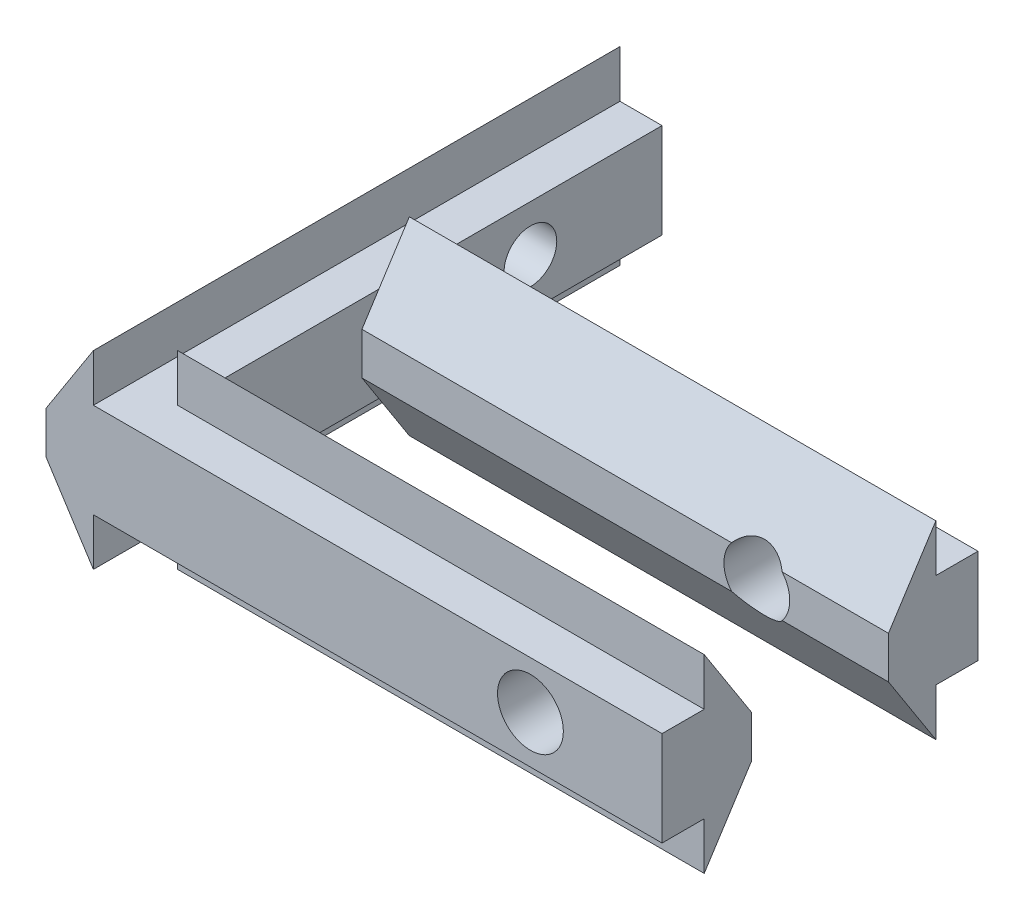
ISO-10303-21;
HEADER;
FILE_DESCRIPTION(('STEP AP214'),'2;1');
FILE_NAME('part.step','',(''),(''),'','','');
FILE_SCHEMA(('AUTOMOTIVE_DESIGN { 1 0 10303 214 1 1 1 1 }'));
ENDSEC;
DATA;
#1=APPLICATION_CONTEXT('core data for automotive mechanical design processes');
#2=APPLICATION_PROTOCOL_DEFINITION('international standard','automotive_design',2000,#1);
#3=PRODUCT_CONTEXT('',#1,'mechanical');
#4=PRODUCT('Part','Part','',(#3));
#5=PRODUCT_RELATED_PRODUCT_CATEGORY('part','',(#4));
#6=PRODUCT_DEFINITION_FORMATION('','',#4);
#7=PRODUCT_DEFINITION_CONTEXT('part definition',#1,'design');
#8=PRODUCT_DEFINITION('design','',#6,#7);
#9=PRODUCT_DEFINITION_SHAPE('','',#8);
#10=(LENGTH_UNIT() NAMED_UNIT(*) SI_UNIT(.MILLI.,.METRE.));
#11=(NAMED_UNIT(*) PLANE_ANGLE_UNIT() SI_UNIT($,.RADIAN.));
#12=(NAMED_UNIT(*) SI_UNIT($,.STERADIAN.) SOLID_ANGLE_UNIT());
#13=UNCERTAINTY_MEASURE_WITH_UNIT(LENGTH_MEASURE(1.E-05),#10,'distance_accuracy_value','');
#14=(GEOMETRIC_REPRESENTATION_CONTEXT(3) GLOBAL_UNCERTAINTY_ASSIGNED_CONTEXT((#13)) GLOBAL_UNIT_ASSIGNED_CONTEXT((#10,
#11,#12)) REPRESENTATION_CONTEXT('',''));
#15=CARTESIAN_POINT('',(0.,0.,0.));
#16=DIRECTION('',(0.,0.,1.));
#17=DIRECTION('',(1.,0.,0.));
#18=AXIS2_PLACEMENT_3D('',#15,#16,#17);
#19=CARTESIAN_POINT('',(23.4,0.,16.6));
#20=DIRECTION('',(0.,0.,1.));
#21=DIRECTION('',(1.,0.,0.));
#22=AXIS2_PLACEMENT_3D('',#19,#20,#21);
#23=PLANE('',#22);
#24=DIRECTION('',(-1.,0.,0.));
#25=VECTOR('',#24,1.);
#26=CARTESIAN_POINT('',(23.4,1.6,16.6));
#27=LINE('',#26,#25);
#28=CARTESIAN_POINT('',(17.4395313643851,1.6,16.6));
#29=VERTEX_POINT('',#28);
#30=CARTESIAN_POINT('',(3.4,1.6,16.6));
#31=VERTEX_POINT('',#30);
#32=EDGE_CURVE('E298',#29,#31,#27,.T.);
#33=ORIENTED_EDGE('',*,*,#32,.F.);
#34=CARTESIAN_POINT('',(18.4,0.8,16.6));
#35=DIRECTION('',(0.,0.,1.));
#36=DIRECTION('',(1.,0.,0.));
#37=AXIS2_PLACEMENT_3D('',#34,#35,#36);
#38=CIRCLE('',#37,1.25);
#39=CARTESIAN_POINT('',(17.4395313643851,0.,16.6));
#40=VERTEX_POINT('',#39);
#41=EDGE_CURVE('E51',#29,#40,#38,.T.);
#42=ORIENTED_EDGE('',*,*,#41,.T.);
#43=DIRECTION('',(-1.,0.,0.));
#44=VECTOR('',#43,1.);
#45=CARTESIAN_POINT('',(23.4,0.,16.6));
#46=LINE('',#45,#44);
#47=CARTESIAN_POINT('',(3.4,0.,16.6));
#48=VERTEX_POINT('',#47);
#49=EDGE_CURVE('E303',#40,#48,#46,.T.);
#50=ORIENTED_EDGE('',*,*,#49,.T.);
#51=DIRECTION('',(0.,1.,0.));
#52=VECTOR('',#51,1.);
#53=CARTESIAN_POINT('',(3.4,0.,16.6));
#54=LINE('',#53,#52);
#55=EDGE_CURVE('E284',#48,#31,#54,.T.);
#56=ORIENTED_EDGE('',*,*,#55,.T.);
#57=EDGE_LOOP('',(#33,#42,#50,#56));
#58=FACE_BOUND('',#57,.T.);
#59=ADVANCED_FACE('F33',(#58),#23,.F.);
#60=CARTESIAN_POINT('',(23.4,1.6,11.4));
#61=DIRECTION('',(0.,0.,-1.));
#62=DIRECTION('',(-1.,0.,0.));
#63=AXIS2_PLACEMENT_3D('',#60,#61,#62);
#64=PLANE('',#63);
#65=DIRECTION('',(-1.,0.,0.));
#66=VECTOR('',#65,1.);
#67=CARTESIAN_POINT('',(23.4,1.6,11.4));
#68=LINE('',#67,#66);
#69=CARTESIAN_POINT('',(23.4,1.6,11.4));
#70=VERTEX_POINT('',#69);
#71=CARTESIAN_POINT('',(19.3604686356149,1.6,11.4));
#72=VERTEX_POINT('',#71);
#73=EDGE_CURVE('E246',#70,#72,#68,.T.);
#74=ORIENTED_EDGE('',*,*,#73,.T.);
#75=CARTESIAN_POINT('',(18.4,0.8,11.4));
#76=DIRECTION('',(0.,0.,-1.));
#77=DIRECTION('',(-1.,0.,0.));
#78=AXIS2_PLACEMENT_3D('',#75,#76,#77);
#79=CIRCLE('',#78,1.25);
#80=CARTESIAN_POINT('',(19.3604686356149,0.,11.4));
#81=VERTEX_POINT('',#80);
#82=EDGE_CURVE('E233',#72,#81,#79,.T.);
#83=ORIENTED_EDGE('',*,*,#82,.T.);
#84=DIRECTION('',(-1.,0.,0.));
#85=VECTOR('',#84,1.);
#86=CARTESIAN_POINT('',(23.4,0.,11.4));
#87=LINE('',#86,#85);
#88=CARTESIAN_POINT('',(23.4,0.,11.4));
#89=VERTEX_POINT('',#88);
#90=EDGE_CURVE('E243',#89,#81,#87,.T.);
#91=ORIENTED_EDGE('',*,*,#90,.F.);
#92=DIRECTION('',(0.,-1.,0.));
#93=VECTOR('',#92,1.);
#94=CARTESIAN_POINT('',(23.4,1.6,11.4));
#95=LINE('',#94,#93);
#96=EDGE_CURVE('E511',#70,#89,#95,.T.);
#97=ORIENTED_EDGE('',*,*,#96,.F.);
#98=EDGE_LOOP('',(#74,#83,#91,#97));
#99=FACE_BOUND('',#98,.T.);
#100=ADVANCED_FACE('F242',(#99),#64,.F.);
#101=CARTESIAN_POINT('',(3.4,2.6,20.));
#102=DIRECTION('',(-1.,0.,0.));
#103=DIRECTION('',(0.,0.,1.));
#104=AXIS2_PLACEMENT_3D('',#101,#102,#103);
#105=PLANE('',#104);
#106=DIRECTION('',(0.,-0.841178475376554,0.540757591313498));
#107=VECTOR('',#106,1.);
#108=CARTESIAN_POINT('',(3.4,4.4,9.6));
#109=LINE('',#108,#107);
#110=CARTESIAN_POINT('',(3.4,2.6,10.7571428571429));
#111=VERTEX_POINT('',#110);
#112=CARTESIAN_POINT('',(3.4,1.6,11.4));
#113=VERTEX_POINT('',#112);
#114=EDGE_CURVE('E409',#111,#113,#109,.T.);
#115=ORIENTED_EDGE('',*,*,#114,.F.);
#116=DIRECTION('',(0.,0.,-1.));
#117=VECTOR('',#116,1.);
#118=CARTESIAN_POINT('',(3.4,2.6,20.));
#119=LINE('',#118,#117);
#120=CARTESIAN_POINT('',(3.4,2.6,17.2428571428571));
#121=VERTEX_POINT('',#120);
#122=EDGE_CURVE('E379',#121,#111,#119,.T.);
#123=ORIENTED_EDGE('',*,*,#122,.F.);
#124=DIRECTION('',(0.,0.841178475376554,0.540757591313499));
#125=VECTOR('',#124,1.);
#126=CARTESIAN_POINT('',(3.4,1.6,16.6));
#127=LINE('',#126,#125);
#128=EDGE_CURVE('E288',#31,#121,#127,.T.);
#129=ORIENTED_EDGE('',*,*,#128,.F.);
#130=ORIENTED_EDGE('',*,*,#55,.F.);
#131=DIRECTION('',(0.,0.841178475376554,-0.540757591313499));
#132=VECTOR('',#131,1.);
#133=CARTESIAN_POINT('',(3.4,-2.8,18.4));
#134=LINE('',#133,#132);
#135=CARTESIAN_POINT('',(3.4,-1.,17.2428571428571));
#136=VERTEX_POINT('',#135);
#137=EDGE_CURVE('E11',#136,#48,#134,.T.);
#138=ORIENTED_EDGE('',*,*,#137,.F.);
#139=DIRECTION('',(0.,0.,-1.));
#140=VECTOR('',#139,1.);
#141=CARTESIAN_POINT('',(3.4,-1.,20.));
#142=LINE('',#141,#140);
#143=CARTESIAN_POINT('',(3.4,-1.,10.7571428571429));
#144=VERTEX_POINT('',#143);
#145=EDGE_CURVE('E388',#136,#144,#142,.T.);
#146=ORIENTED_EDGE('',*,*,#145,.T.);
#147=DIRECTION('',(0.,-0.841178475376553,-0.540757591313499));
#148=VECTOR('',#147,1.);
#149=CARTESIAN_POINT('',(3.4,0.,11.4));
#150=LINE('',#149,#148);
#151=CARTESIAN_POINT('',(3.4,0.,11.4));
#152=VERTEX_POINT('',#151);
#153=EDGE_CURVE('E427',#152,#144,#150,.T.);
#154=ORIENTED_EDGE('',*,*,#153,.F.);
#155=DIRECTION('',(0.,-1.,0.));
#156=VECTOR('',#155,1.);
#157=CARTESIAN_POINT('',(3.4,1.6,11.4));
#158=LINE('',#157,#156);
#159=EDGE_CURVE('E412',#113,#152,#158,.T.);
#160=ORIENTED_EDGE('',*,*,#159,.F.);
#161=EDGE_LOOP('',(#115,#123,#129,#130,#138,#146,#154,#160));
#162=FACE_BOUND('',#161,.T.);
#163=ADVANCED_FACE('F405',(#162),#105,.F.);
#164=CARTESIAN_POINT('',(3.4,0.8,5.));
#165=DIRECTION('',(1.,0.,0.));
#166=DIRECTION('',(0.,0.,-1.));
#167=AXIS2_PLACEMENT_3D('',#164,#165,#166);
#168=CIRCLE('',#167,1.);
#169=CARTESIAN_POINT('',(3.4,0.8,4.));
#170=VERTEX_POINT('',#169);
#171=EDGE_CURVE('E307',#170,#170,#168,.T.);
#172=ORIENTED_EDGE('',*,*,#171,.F.);
#173=EDGE_LOOP('',(#172));
#174=FACE_BOUND('',#173,.T.);
#175=DIRECTION('',(0.,1.,0.));
#176=VECTOR('',#175,1.);
#177=CARTESIAN_POINT('',(3.4,2.6,8.));
#178=LINE('',#177,#176);
#179=CARTESIAN_POINT('',(3.4,-1.,8.));
#180=VERTEX_POINT('',#179);
#181=CARTESIAN_POINT('',(3.4,2.6,8.));
#182=VERTEX_POINT('',#181);
#183=EDGE_CURVE('E433',#180,#182,#178,.T.);
#184=ORIENTED_EDGE('',*,*,#183,.F.);
#185=CARTESIAN_POINT('',(3.4,-1.,0.));
#186=VERTEX_POINT('',#185);
#187=EDGE_CURVE('E387',#180,#186,#142,.T.);
#188=ORIENTED_EDGE('',*,*,#187,.T.);
#189=DIRECTION('',(0.,1.,0.));
#190=VECTOR('',#189,1.);
#191=CARTESIAN_POINT('',(3.4,2.6,0.));
#192=LINE('',#191,#190);
#193=CARTESIAN_POINT('',(3.4,2.6,0.));
#194=VERTEX_POINT('',#193);
#195=EDGE_CURVE('E341',#186,#194,#192,.T.);
#196=ORIENTED_EDGE('',*,*,#195,.T.);
#197=EDGE_CURVE('E366',#182,#194,#119,.T.);
#198=ORIENTED_EDGE('',*,*,#197,.F.);
#199=EDGE_LOOP('',(#184,#188,#196,#198));
#200=FACE_BOUND('',#199,.T.);
#201=ADVANCED_FACE('F594',(#174,#200),#105,.F.);
#202=CARTESIAN_POINT('',(0.,0.,20.));
#203=DIRECTION('',(1.,0.,0.));
#204=DIRECTION('',(0.,0.,-1.));
#205=AXIS2_PLACEMENT_3D('',#202,#203,#204);
#206=PLANE('',#205);
#207=DIRECTION('',(0.,0.,-1.));
#208=VECTOR('',#207,1.);
#209=CARTESIAN_POINT('',(0.,1.6,20.));
#210=LINE('',#209,#208);
#211=CARTESIAN_POINT('',(0.,1.6,20.));
#212=VERTEX_POINT('',#211);
#213=CARTESIAN_POINT('',(0.,1.6,5.6));
#214=VERTEX_POINT('',#213);
#215=EDGE_CURVE('E357',#212,#214,#210,.T.);
#216=ORIENTED_EDGE('',*,*,#215,.T.);
#217=CARTESIAN_POINT('',(0.,0.8,5.));
#218=DIRECTION('',(1.,0.,0.));
#219=DIRECTION('',(0.,0.,-1.));
#220=AXIS2_PLACEMENT_3D('',#217,#218,#219);
#221=CIRCLE('',#220,1.);
#222=CARTESIAN_POINT('',(0.,0.,5.6));
#223=VERTEX_POINT('',#222);
#224=EDGE_CURVE('E42',#214,#223,#221,.T.);
#225=ORIENTED_EDGE('',*,*,#224,.T.);
#226=DIRECTION('',(0.,0.,-1.));
#227=VECTOR('',#226,1.);
#228=CARTESIAN_POINT('',(0.,0.,20.));
#229=LINE('',#228,#227);
#230=CARTESIAN_POINT('',(0.,0.,20.));
#231=VERTEX_POINT('',#230);
#232=EDGE_CURVE('E353',#231,#223,#229,.T.);
#233=ORIENTED_EDGE('',*,*,#232,.F.);
#234=DIRECTION('',(0.,-1.,0.));
#235=VECTOR('',#234,1.);
#236=CARTESIAN_POINT('',(0.,0.,20.));
#237=LINE('',#236,#235);
#238=EDGE_CURVE('E331',#212,#231,#237,.T.);
#239=ORIENTED_EDGE('',*,*,#238,.F.);
#240=EDGE_LOOP('',(#216,#225,#233,#239));
#241=FACE_BOUND('',#240,.T.);
#242=ADVANCED_FACE('F611',(#241),#206,.F.);
#243=CARTESIAN_POINT('',(0.,0.,20.));
#244=DIRECTION('',(0.841178475376554,0.540757591313499,0.));
#245=DIRECTION('',(-0.540757591313499,0.841178475376554,0.));
#246=AXIS2_PLACEMENT_3D('',#243,#244,#245);
#247=PLANE('',#246);
#248=ORIENTED_EDGE('',*,*,#232,.T.);
#249=CARTESIAN_POINT('',(-0.514285714285714,0.8,5.));
#250=DIRECTION('',(0.841178475376554,0.540757591313499,0.));
#251=DIRECTION('',(0.540757591313499,-0.841178475376554,0.));
#252=AXIS2_PLACEMENT_3D('',#249,#250,#251);
#253=ELLIPSE('',#252,1.18880835550666,1.);
#254=CARTESIAN_POINT('',(0.,0.,4.4));
#255=VERTEX_POINT('',#254);
#256=EDGE_CURVE('E313',#223,#255,#253,.T.);
#257=ORIENTED_EDGE('',*,*,#256,.T.);
#258=CARTESIAN_POINT('',(0.,0.,0.));
#259=VERTEX_POINT('',#258);
#260=EDGE_CURVE('E333',#255,#259,#229,.T.);
#261=ORIENTED_EDGE('',*,*,#260,.T.);
#262=DIRECTION('',(0.540757591313499,-0.841178475376554,0.));
#263=VECTOR('',#262,1.);
#264=CARTESIAN_POINT('',(0.,0.,0.));
#265=LINE('',#264,#263);
#266=CARTESIAN_POINT('',(1.8,-2.8,0.));
#267=VERTEX_POINT('',#266);
#268=EDGE_CURVE('E316',#259,#267,#265,.T.);
#269=ORIENTED_EDGE('',*,*,#268,.T.);
#270=DIRECTION('',(0.,0.,-1.));
#271=VECTOR('',#270,1.);
#272=CARTESIAN_POINT('',(1.8,-2.8,20.));
#273=LINE('',#272,#271);
#274=CARTESIAN_POINT('',(1.8,-2.8,20.));
#275=VERTEX_POINT('',#274);
#276=EDGE_CURVE('E478',#275,#267,#273,.T.);
#277=ORIENTED_EDGE('',*,*,#276,.F.);
#278=DIRECTION('',(0.540757591313499,-0.841178475376554,0.));
#279=VECTOR('',#278,1.);
#280=CARTESIAN_POINT('',(0.,0.,20.));
#281=LINE('',#280,#279);
#282=EDGE_CURVE('E317',#231,#275,#281,.T.);
#283=ORIENTED_EDGE('',*,*,#282,.F.);
#284=EDGE_LOOP('',(#248,#257,#261,#269,#277,#283));
#285=FACE_BOUND('',#284,.T.);
#286=ADVANCED_FACE('F35',(#285),#247,.F.);
#287=CARTESIAN_POINT('',(1.8,-1.,20.));
#288=DIRECTION('',(-1.,0.,0.));
#289=DIRECTION('',(0.,0.,1.));
#290=AXIS2_PLACEMENT_3D('',#287,#288,#289);
#291=PLANE('',#290);
#292=DIRECTION('',(0.,1.,0.));
#293=VECTOR('',#292,1.);
#294=CARTESIAN_POINT('',(1.8,-1.,0.));
#295=LINE('',#294,#293);
#296=CARTESIAN_POINT('',(1.8,-1.,0.));
#297=VERTEX_POINT('',#296);
#298=EDGE_CURVE('E336',#267,#297,#295,.T.);
#299=ORIENTED_EDGE('',*,*,#298,.T.);
#300=DIRECTION('',(0.,0.,-1.));
#301=VECTOR('',#300,1.);
#302=CARTESIAN_POINT('',(1.8,-1.,20.));
#303=LINE('',#302,#301);
#304=CARTESIAN_POINT('',(1.8,-1.,20.));
#305=VERTEX_POINT('',#304);
#306=EDGE_CURVE('E476',#305,#297,#303,.T.);
#307=ORIENTED_EDGE('',*,*,#306,.F.);
#308=DIRECTION('',(0.,1.,0.));
#309=VECTOR('',#308,1.);
#310=CARTESIAN_POINT('',(1.8,-1.,20.));
#311=LINE('',#310,#309);
#312=EDGE_CURVE('E320',#275,#305,#311,.T.);
#313=ORIENTED_EDGE('',*,*,#312,.F.);
#314=ORIENTED_EDGE('',*,*,#276,.T.);
#315=EDGE_LOOP('',(#299,#307,#313,#314));
#316=FACE_BOUND('',#315,.T.);
#317=ADVANCED_FACE('F583',(#316),#291,.F.);
#318=CARTESIAN_POINT('',(3.4,-1.,20.));
#319=DIRECTION('',(0.,1.,0.));
#320=DIRECTION('',(0.,0.,1.));
#321=AXIS2_PLACEMENT_3D('',#318,#319,#320);
#322=PLANE('',#321);
#323=DIRECTION('',(1.,0.,0.));
#324=VECTOR('',#323,1.);
#325=CARTESIAN_POINT('',(3.4,-1.,0.));
#326=LINE('',#325,#324);
#327=EDGE_CURVE('E338',#297,#186,#326,.T.);
#328=ORIENTED_EDGE('',*,*,#327,.T.);
#329=ORIENTED_EDGE('',*,*,#187,.F.);
#330=DIRECTION('',(-1.,0.,0.));
#331=VECTOR('',#330,1.);
#332=CARTESIAN_POINT('',(23.4,-1.,8.));
#333=LINE('',#332,#331);
#334=CARTESIAN_POINT('',(23.4,-1.,8.));
#335=VERTEX_POINT('',#334);
#336=EDGE_CURVE('E447',#335,#180,#333,.T.);
#337=ORIENTED_EDGE('',*,*,#336,.F.);
#338=DIRECTION('',(0.,0.,-1.));
#339=VECTOR('',#338,1.);
#340=CARTESIAN_POINT('',(23.4,-1.,8.));
#341=LINE('',#340,#339);
#342=CARTESIAN_POINT('',(23.4,-1.,9.6));
#343=VERTEX_POINT('',#342);
#344=EDGE_CURVE('E515',#343,#335,#341,.T.);
#345=ORIENTED_EDGE('',*,*,#344,.F.);
#346=DIRECTION('',(-1.,0.,0.));
#347=VECTOR('',#346,1.);
#348=CARTESIAN_POINT('',(23.4,-1.,9.6));
#349=LINE('',#348,#347);
#350=CARTESIAN_POINT('',(3.4,-1.,9.6));
#351=VERTEX_POINT('',#350);
#352=EDGE_CURVE('E448',#343,#351,#349,.T.);
#353=ORIENTED_EDGE('',*,*,#352,.T.);
#354=DIRECTION('',(0.,0.,-1.));
#355=VECTOR('',#354,1.);
#356=CARTESIAN_POINT('',(3.4,-1.,20.));
#357=LINE('',#356,#355);
#358=EDGE_CURVE('E260',#144,#351,#357,.T.);
#359=ORIENTED_EDGE('',*,*,#358,.F.);
#360=ORIENTED_EDGE('',*,*,#145,.F.);
#361=CARTESIAN_POINT('',(3.4,-1.,18.4));
#362=VERTEX_POINT('',#361);
#363=EDGE_CURVE('E393',#362,#136,#142,.T.);
#364=ORIENTED_EDGE('',*,*,#363,.F.);
#365=DIRECTION('',(-1.,0.,0.));
#366=VECTOR('',#365,1.);
#367=CARTESIAN_POINT('',(23.4,-1.,18.4));
#368=LINE('',#367,#366);
#369=CARTESIAN_POINT('',(23.4,-1.,18.4));
#370=VERTEX_POINT('',#369);
#371=EDGE_CURVE('E294',#370,#362,#368,.T.);
#372=ORIENTED_EDGE('',*,*,#371,.F.);
#373=DIRECTION('',(0.,0.,-1.));
#374=VECTOR('',#373,1.);
#375=CARTESIAN_POINT('',(23.4,-1.,20.));
#376=LINE('',#375,#374);
#377=CARTESIAN_POINT('',(23.4,-1.,20.));
#378=VERTEX_POINT('',#377);
#379=EDGE_CURVE('E278',#378,#370,#376,.T.);
#380=ORIENTED_EDGE('',*,*,#379,.F.);
#381=DIRECTION('',(1.,0.,0.));
#382=VECTOR('',#381,1.);
#383=CARTESIAN_POINT('',(3.4,-1.,20.));
#384=LINE('',#383,#382);
#385=EDGE_CURVE('E323',#305,#378,#384,.T.);
#386=ORIENTED_EDGE('',*,*,#385,.F.);
#387=ORIENTED_EDGE('',*,*,#306,.T.);
#388=EDGE_LOOP('',(#328,#329,#337,#345,#353,#359,#360,#364,#372,#380,#386,#387));
#389=FACE_BOUND('',#388,.T.);
#390=ADVANCED_FACE('F463',(#389),#322,.F.);
#391=CARTESIAN_POINT('',(1.8,2.6,20.));
#392=DIRECTION('',(0.,-1.,0.));
#393=DIRECTION('',(0.,0.,-1.));
#394=AXIS2_PLACEMENT_3D('',#391,#392,#393);
#395=PLANE('',#394);
#396=DIRECTION('',(-1.,0.,0.));
#397=VECTOR('',#396,1.);
#398=CARTESIAN_POINT('',(1.8,2.6,0.));
#399=LINE('',#398,#397);
#400=CARTESIAN_POINT('',(1.8,2.6,0.));
#401=VERTEX_POINT('',#400);
#402=EDGE_CURVE('E344',#194,#401,#399,.T.);
#403=ORIENTED_EDGE('',*,*,#402,.T.);
#404=DIRECTION('',(0.,0.,-1.));
#405=VECTOR('',#404,1.);
#406=CARTESIAN_POINT('',(1.8,2.6,20.));
#407=LINE('',#406,#405);
#408=CARTESIAN_POINT('',(1.8,2.6,20.));
#409=VERTEX_POINT('',#408);
#410=EDGE_CURVE('E363',#409,#401,#407,.T.);
#411=ORIENTED_EDGE('',*,*,#410,.F.);
#412=DIRECTION('',(-1.,0.,0.));
#413=VECTOR('',#412,1.);
#414=CARTESIAN_POINT('',(1.8,2.6,20.));
#415=LINE('',#414,#413);
#416=CARTESIAN_POINT('',(23.4,2.6,20.));
#417=VERTEX_POINT('',#416);
#418=EDGE_CURVE('E325',#417,#409,#415,.T.);
#419=ORIENTED_EDGE('',*,*,#418,.F.);
#420=DIRECTION('',(0.,0.,1.));
#421=VECTOR('',#420,1.);
#422=CARTESIAN_POINT('',(23.4,2.6,18.4));
#423=LINE('',#422,#421);
#424=CARTESIAN_POINT('',(23.4,2.6,18.4));
#425=VERTEX_POINT('',#424);
#426=EDGE_CURVE('E272',#425,#417,#423,.T.);
#427=ORIENTED_EDGE('',*,*,#426,.F.);
#428=DIRECTION('',(-1.,0.,0.));
#429=VECTOR('',#428,1.);
#430=CARTESIAN_POINT('',(23.4,2.6,18.4));
#431=LINE('',#430,#429);
#432=CARTESIAN_POINT('',(3.4,2.6,18.4));
#433=VERTEX_POINT('',#432);
#434=EDGE_CURVE('E299',#425,#433,#431,.T.);
#435=ORIENTED_EDGE('',*,*,#434,.T.);
#436=EDGE_CURVE('E374',#433,#121,#119,.T.);
#437=ORIENTED_EDGE('',*,*,#436,.T.);
#438=ORIENTED_EDGE('',*,*,#122,.T.);
#439=CARTESIAN_POINT('',(3.4,2.6,9.6));
#440=VERTEX_POINT('',#439);
#441=EDGE_CURVE('E382',#111,#440,#119,.T.);
#442=ORIENTED_EDGE('',*,*,#441,.T.);
#443=DIRECTION('',(-1.,0.,0.));
#444=VECTOR('',#443,1.);
#445=CARTESIAN_POINT('',(23.4,2.6,9.6));
#446=LINE('',#445,#444);
#447=CARTESIAN_POINT('',(23.4,2.6,9.6));
#448=VERTEX_POINT('',#447);
#449=EDGE_CURVE('E441',#448,#440,#446,.T.);
#450=ORIENTED_EDGE('',*,*,#449,.F.);
#451=DIRECTION('',(0.,0.,1.));
#452=VECTOR('',#451,1.);
#453=CARTESIAN_POINT('',(23.4,2.6,9.6));
#454=LINE('',#453,#452);
#455=CARTESIAN_POINT('',(23.4,2.6,8.));
#456=VERTEX_POINT('',#455);
#457=EDGE_CURVE('E518',#456,#448,#454,.T.);
#458=ORIENTED_EDGE('',*,*,#457,.F.);
#459=DIRECTION('',(-1.,0.,0.));
#460=VECTOR('',#459,1.);
#461=CARTESIAN_POINT('',(23.4,2.6,8.));
#462=LINE('',#461,#460);
#463=EDGE_CURVE('E444',#456,#182,#462,.T.);
#464=ORIENTED_EDGE('',*,*,#463,.T.);
#465=ORIENTED_EDGE('',*,*,#197,.T.);
#466=EDGE_LOOP('',(#403,#411,#419,#427,#435,#437,#438,#442,#450,#458,#464,#465));
#467=FACE_BOUND('',#466,.T.);
#468=ADVANCED_FACE('F400',(#467),#395,.F.);
#469=CARTESIAN_POINT('',(1.8,4.4,20.));
#470=DIRECTION('',(-1.,0.,0.));
#471=DIRECTION('',(0.,0.,1.));
#472=AXIS2_PLACEMENT_3D('',#469,#470,#471);
#473=PLANE('',#472);
#474=DIRECTION('',(0.,1.,0.));
#475=VECTOR('',#474,1.);
#476=CARTESIAN_POINT('',(1.8,4.4,0.));
#477=LINE('',#476,#475);
#478=CARTESIAN_POINT('',(1.8,4.4,0.));
#479=VERTEX_POINT('',#478);
#480=EDGE_CURVE('E346',#401,#479,#477,.T.);
#481=ORIENTED_EDGE('',*,*,#480,.T.);
#482=DIRECTION('',(0.,0.,-1.));
#483=VECTOR('',#482,1.);
#484=CARTESIAN_POINT('',(1.8,4.4,20.));
#485=LINE('',#484,#483);
#486=CARTESIAN_POINT('',(1.8,4.4,20.));
#487=VERTEX_POINT('',#486);
#488=EDGE_CURVE('E360',#487,#479,#485,.T.);
#489=ORIENTED_EDGE('',*,*,#488,.F.);
#490=DIRECTION('',(0.,1.,0.));
#491=VECTOR('',#490,1.);
#492=CARTESIAN_POINT('',(1.8,4.4,20.));
#493=LINE('',#492,#491);
#494=EDGE_CURVE('E327',#409,#487,#493,.T.);
#495=ORIENTED_EDGE('',*,*,#494,.F.);
#496=ORIENTED_EDGE('',*,*,#410,.T.);
#497=EDGE_LOOP('',(#481,#489,#495,#496));
#498=FACE_BOUND('',#497,.T.);
#499=ADVANCED_FACE('F600',(#498),#473,.F.);
#500=CARTESIAN_POINT('',(0.,1.6,20.));
#501=DIRECTION('',(0.841178475376554,-0.540757591313499,0.));
#502=DIRECTION('',(0.540757591313499,0.841178475376554,0.));
#503=AXIS2_PLACEMENT_3D('',#500,#501,#502);
#504=PLANE('',#503);
#505=CARTESIAN_POINT('',(0.,1.6,4.4));
#506=VERTEX_POINT('',#505);
#507=CARTESIAN_POINT('',(0.,1.6,0.));
#508=VERTEX_POINT('',#507);
#509=EDGE_CURVE('E356',#506,#508,#210,.T.);
#510=ORIENTED_EDGE('',*,*,#509,.F.);
#511=CARTESIAN_POINT('',(-0.514285714285714,0.8,5.));
#512=DIRECTION('',(0.841178475376554,-0.540757591313499,0.));
#513=DIRECTION('',(0.540757591313499,0.841178475376554,0.));
#514=AXIS2_PLACEMENT_3D('',#511,#512,#513);
#515=ELLIPSE('',#514,1.18880835550666,1.);
#516=EDGE_CURVE('E310',#506,#214,#515,.T.);
#517=ORIENTED_EDGE('',*,*,#516,.T.);
#518=ORIENTED_EDGE('',*,*,#215,.F.);
#519=DIRECTION('',(-0.540757591313499,-0.841178475376554,0.));
#520=VECTOR('',#519,1.);
#521=CARTESIAN_POINT('',(0.,1.6,20.));
#522=LINE('',#521,#520);
#523=EDGE_CURVE('E329',#487,#212,#522,.T.);
#524=ORIENTED_EDGE('',*,*,#523,.F.);
#525=ORIENTED_EDGE('',*,*,#488,.T.);
#526=DIRECTION('',(-0.540757591313499,-0.841178475376554,0.));
#527=VECTOR('',#526,1.);
#528=CARTESIAN_POINT('',(0.,1.6,0.));
#529=LINE('',#528,#527);
#530=EDGE_CURVE('E348',#479,#508,#529,.T.);
#531=ORIENTED_EDGE('',*,*,#530,.T.);
#532=EDGE_LOOP('',(#510,#517,#518,#524,#525,#531));
#533=FACE_BOUND('',#532,.T.);
#534=ADVANCED_FACE('F608',(#533),#504,.F.);
#535=ORIENTED_EDGE('',*,*,#260,.F.);
#536=EDGE_CURVE('E613',#255,#506,#221,.T.);
#537=ORIENTED_EDGE('',*,*,#536,.T.);
#538=ORIENTED_EDGE('',*,*,#509,.T.);
#539=DIRECTION('',(0.,-1.,0.));
#540=VECTOR('',#539,1.);
#541=CARTESIAN_POINT('',(0.,0.,0.));
#542=LINE('',#541,#540);
#543=EDGE_CURVE('E321',#508,#259,#542,.T.);
#544=ORIENTED_EDGE('',*,*,#543,.T.);
#545=EDGE_LOOP('',(#535,#537,#538,#544));
#546=FACE_BOUND('',#545,.T.);
#547=ADVANCED_FACE('F618',(#546),#206,.F.);
#548=CARTESIAN_POINT('',(0.,0.,20.));
#549=DIRECTION('',(0.,0.,1.));
#550=DIRECTION('',(1.,0.,0.));
#551=AXIS2_PLACEMENT_3D('',#548,#549,#550);
#552=PLANE('',#551);
#553=CARTESIAN_POINT('',(18.4,0.8,20.));
#554=DIRECTION('',(0.,0.,1.));
#555=DIRECTION('',(1.,0.,0.));
#556=AXIS2_PLACEMENT_3D('',#553,#554,#555);
#557=CIRCLE('',#556,1.25);
#558=CARTESIAN_POINT('',(19.65,0.8,20.));
#559=VERTEX_POINT('',#558);
#560=EDGE_CURVE('E530',#559,#559,#557,.T.);
#561=ORIENTED_EDGE('',*,*,#560,.F.);
#562=EDGE_LOOP('',(#561));
#563=FACE_BOUND('',#562,.T.);
#564=ORIENTED_EDGE('',*,*,#282,.T.);
#565=ORIENTED_EDGE('',*,*,#312,.T.);
#566=ORIENTED_EDGE('',*,*,#385,.T.);
#567=DIRECTION('',(0.,-1.,0.));
#568=VECTOR('',#567,1.);
#569=CARTESIAN_POINT('',(23.4,2.6,20.));
#570=LINE('',#569,#568);
#571=EDGE_CURVE('E275',#417,#378,#570,.T.);
#572=ORIENTED_EDGE('',*,*,#571,.F.);
#573=ORIENTED_EDGE('',*,*,#418,.T.);
#574=ORIENTED_EDGE('',*,*,#494,.T.);
#575=ORIENTED_EDGE('',*,*,#523,.T.);
#576=ORIENTED_EDGE('',*,*,#238,.T.);
#577=EDGE_LOOP('',(#564,#565,#566,#572,#573,#574,#575,#576));
#578=FACE_BOUND('',#577,.T.);
#579=ADVANCED_FACE('F577',(#563,#578),#552,.T.);
#580=CARTESIAN_POINT('',(0.,0.,0.));
#581=DIRECTION('',(0.,0.,1.));
#582=DIRECTION('',(1.,0.,0.));
#583=AXIS2_PLACEMENT_3D('',#580,#581,#582);
#584=PLANE('',#583);
#585=ORIENTED_EDGE('',*,*,#268,.F.);
#586=ORIENTED_EDGE('',*,*,#543,.F.);
#587=ORIENTED_EDGE('',*,*,#530,.F.);
#588=ORIENTED_EDGE('',*,*,#480,.F.);
#589=ORIENTED_EDGE('',*,*,#402,.F.);
#590=ORIENTED_EDGE('',*,*,#195,.F.);
#591=ORIENTED_EDGE('',*,*,#327,.F.);
#592=ORIENTED_EDGE('',*,*,#298,.F.);
#593=EDGE_LOOP('',(#585,#586,#587,#588,#589,#590,#591,#592));
#594=FACE_BOUND('',#593,.T.);
#595=ADVANCED_FACE('F586',(#594),#584,.F.);
#596=CARTESIAN_POINT('',(0.,0.8,5.));
#597=DIRECTION('',(1.,0.,0.));
#598=DIRECTION('',(0.,0.,-1.));
#599=AXIS2_PLACEMENT_3D('',#596,#597,#598);
#600=CYLINDRICAL_SURFACE('',#599,1.);
#601=ORIENTED_EDGE('',*,*,#171,.T.);
#602=EDGE_LOOP('',(#601));
#603=FACE_BOUND('',#602,.T.);
#604=ORIENTED_EDGE('',*,*,#224,.F.);
#605=ORIENTED_EDGE('',*,*,#516,.F.);
#606=ORIENTED_EDGE('',*,*,#536,.F.);
#607=ORIENTED_EDGE('',*,*,#256,.F.);
#608=EDGE_LOOP('',(#604,#605,#606,#607));
#609=FACE_BOUND('',#608,.T.);
#610=ADVANCED_FACE('F620',(#603,#609),#600,.F.);
#611=CARTESIAN_POINT('',(3.4,0.,0.));
#612=DIRECTION('',(1.,0.,0.));
#613=DIRECTION('',(0.,0.,-1.));
#614=AXIS2_PLACEMENT_3D('',#611,#612,#613);
#615=PLANE('',#614);
#616=DIRECTION('',(0.,-1.,0.));
#617=VECTOR('',#616,1.);
#618=CARTESIAN_POINT('',(3.4,-1.,18.4));
#619=LINE('',#618,#617);
#620=CARTESIAN_POINT('',(3.4,-2.8,18.4));
#621=VERTEX_POINT('',#620);
#622=EDGE_CURVE('E266',#362,#621,#619,.T.);
#623=ORIENTED_EDGE('',*,*,#622,.F.);
#624=ORIENTED_EDGE('',*,*,#363,.T.);
#625=EDGE_CURVE('E44',#621,#136,#134,.T.);
#626=ORIENTED_EDGE('',*,*,#625,.F.);
#627=EDGE_LOOP('',(#623,#624,#626));
#628=FACE_BOUND('',#627,.T.);
#629=ADVANCED_FACE('F473',(#628),#615,.F.);
#630=CARTESIAN_POINT('',(23.4,-2.8,18.4));
#631=DIRECTION('',(0.,0.540757591313499,0.841178475376554));
#632=DIRECTION('',(0.,-0.841178475376554,0.540757591313499));
#633=AXIS2_PLACEMENT_3D('',#630,#631,#632);
#634=PLANE('',#633);
#635=ORIENTED_EDGE('',*,*,#49,.F.);
#636=CARTESIAN_POINT('',(18.4,0.8,16.0857142857143));
#637=DIRECTION('',(0.,0.540757591313499,0.841178475376554));
#638=DIRECTION('',(0.,-0.841178475376554,0.540757591313499));
#639=AXIS2_PLACEMENT_3D('',#636,#637,#638);
#640=ELLIPSE('',#639,1.48601044438333,1.25);
#641=CARTESIAN_POINT('',(19.3604686356149,0.,16.6));
#642=VERTEX_POINT('',#641);
#643=EDGE_CURVE('E417',#40,#642,#640,.T.);
#644=ORIENTED_EDGE('',*,*,#643,.T.);
#645=CARTESIAN_POINT('',(23.4,0.,16.6));
#646=VERTEX_POINT('',#645);
#647=EDGE_CURVE('E304',#646,#642,#46,.T.);
#648=ORIENTED_EDGE('',*,*,#647,.F.);
#649=DIRECTION('',(0.,0.841178475376554,-0.540757591313499));
#650=VECTOR('',#649,1.);
#651=CARTESIAN_POINT('',(23.4,-2.8,18.4));
#652=LINE('',#651,#650);
#653=CARTESIAN_POINT('',(23.4,-2.8,18.4));
#654=VERTEX_POINT('',#653);
#655=EDGE_CURVE('E262',#654,#646,#652,.T.);
#656=ORIENTED_EDGE('',*,*,#655,.F.);
#657=DIRECTION('',(-1.,0.,0.));
#658=VECTOR('',#657,1.);
#659=CARTESIAN_POINT('',(23.4,-2.8,18.4));
#660=LINE('',#659,#658);
#661=EDGE_CURVE('E281',#654,#621,#660,.T.);
#662=ORIENTED_EDGE('',*,*,#661,.T.);
#663=ORIENTED_EDGE('',*,*,#625,.T.);
#664=ORIENTED_EDGE('',*,*,#137,.T.);
#665=EDGE_LOOP('',(#635,#644,#648,#656,#662,#663,#664));
#666=FACE_BOUND('',#665,.T.);
#667=ADVANCED_FACE('F467',(#666),#634,.F.);
#668=ORIENTED_EDGE('',*,*,#647,.T.);
#669=CARTESIAN_POINT('',(19.3604686356149,1.6,16.6));
#670=VERTEX_POINT('',#669);
#671=EDGE_CURVE('E503',#642,#670,#38,.T.);
#672=ORIENTED_EDGE('',*,*,#671,.T.);
#673=CARTESIAN_POINT('',(23.4,1.6,16.6));
#674=VERTEX_POINT('',#673);
#675=EDGE_CURVE('E300',#674,#670,#27,.T.);
#676=ORIENTED_EDGE('',*,*,#675,.F.);
#677=DIRECTION('',(0.,1.,0.));
#678=VECTOR('',#677,1.);
#679=CARTESIAN_POINT('',(23.4,0.,16.6));
#680=LINE('',#679,#678);
#681=EDGE_CURVE('E265',#646,#674,#680,.T.);
#682=ORIENTED_EDGE('',*,*,#681,.F.);
#683=EDGE_LOOP('',(#668,#672,#676,#682));
#684=FACE_BOUND('',#683,.T.);
#685=ADVANCED_FACE('F550',(#684),#23,.F.);
#686=CARTESIAN_POINT('',(23.4,1.6,16.6));
#687=DIRECTION('',(0.,-0.540757591313499,0.841178475376554));
#688=DIRECTION('',(0.,-0.841178475376554,-0.540757591313499));
#689=AXIS2_PLACEMENT_3D('',#686,#687,#688);
#690=PLANE('',#689);
#691=ORIENTED_EDGE('',*,*,#675,.T.);
#692=CARTESIAN_POINT('',(18.4,0.8,16.0857142857143));
#693=DIRECTION('',(0.,-0.540757591313499,0.841178475376554));
#694=DIRECTION('',(0.,0.841178475376554,0.540757591313499));
#695=AXIS2_PLACEMENT_3D('',#692,#693,#694);
#696=ELLIPSE('',#695,1.48601044438333,1.25);
#697=EDGE_CURVE('E501',#670,#29,#696,.T.);
#698=ORIENTED_EDGE('',*,*,#697,.T.);
#699=ORIENTED_EDGE('',*,*,#32,.T.);
#700=ORIENTED_EDGE('',*,*,#128,.T.);
#701=CARTESIAN_POINT('',(3.4,4.4,18.4));
#702=VERTEX_POINT('',#701);
#703=EDGE_CURVE('E287',#121,#702,#127,.T.);
#704=ORIENTED_EDGE('',*,*,#703,.T.);
#705=DIRECTION('',(-1.,0.,0.));
#706=VECTOR('',#705,1.);
#707=CARTESIAN_POINT('',(23.4,4.4,18.4));
#708=LINE('',#707,#706);
#709=CARTESIAN_POINT('',(23.4,4.4,18.4));
#710=VERTEX_POINT('',#709);
#711=EDGE_CURVE('E295',#710,#702,#708,.T.);
#712=ORIENTED_EDGE('',*,*,#711,.F.);
#713=DIRECTION('',(0.,0.841178475376554,0.540757591313499));
#714=VECTOR('',#713,1.);
#715=CARTESIAN_POINT('',(23.4,1.6,16.6));
#716=LINE('',#715,#714);
#717=EDGE_CURVE('E268',#674,#710,#716,.T.);
#718=ORIENTED_EDGE('',*,*,#717,.F.);
#719=EDGE_LOOP('',(#691,#698,#699,#700,#704,#712,#718));
#720=FACE_BOUND('',#719,.T.);
#721=ADVANCED_FACE('F499',(#720),#690,.F.);
#722=CARTESIAN_POINT('',(23.4,4.4,18.4));
#723=DIRECTION('',(0.,0.,-1.));
#724=DIRECTION('',(-1.,0.,0.));
#725=AXIS2_PLACEMENT_3D('',#722,#723,#724);
#726=PLANE('',#725);
#727=DIRECTION('',(0.,-1.,0.));
#728=VECTOR('',#727,1.);
#729=CARTESIAN_POINT('',(3.4,4.4,18.4));
#730=LINE('',#729,#728);
#731=EDGE_CURVE('E291',#702,#433,#730,.T.);
#732=ORIENTED_EDGE('',*,*,#731,.T.);
#733=ORIENTED_EDGE('',*,*,#434,.F.);
#734=DIRECTION('',(0.,-1.,0.));
#735=VECTOR('',#734,1.);
#736=CARTESIAN_POINT('',(23.4,4.4,18.4));
#737=LINE('',#736,#735);
#738=EDGE_CURVE('E270',#710,#425,#737,.T.);
#739=ORIENTED_EDGE('',*,*,#738,.F.);
#740=ORIENTED_EDGE('',*,*,#711,.T.);
#741=EDGE_LOOP('',(#732,#733,#739,#740));
#742=FACE_BOUND('',#741,.T.);
#743=ADVANCED_FACE('F493',(#742),#726,.F.);
#744=CARTESIAN_POINT('',(23.4,-1.,18.4));
#745=DIRECTION('',(0.,0.,-1.));
#746=DIRECTION('',(-1.,0.,0.));
#747=AXIS2_PLACEMENT_3D('',#744,#745,#746);
#748=PLANE('',#747);
#749=ORIENTED_EDGE('',*,*,#622,.T.);
#750=ORIENTED_EDGE('',*,*,#661,.F.);
#751=DIRECTION('',(0.,-1.,0.));
#752=VECTOR('',#751,1.);
#753=CARTESIAN_POINT('',(23.4,-1.,18.4));
#754=LINE('',#753,#752);
#755=EDGE_CURVE('E280',#370,#654,#754,.T.);
#756=ORIENTED_EDGE('',*,*,#755,.F.);
#757=ORIENTED_EDGE('',*,*,#371,.T.);
#758=EDGE_LOOP('',(#749,#750,#756,#757));
#759=FACE_BOUND('',#758,.T.);
#760=ADVANCED_FACE('F571',(#759),#748,.F.);
#761=CARTESIAN_POINT('',(23.4,0.,0.));
#762=DIRECTION('',(1.,0.,0.));
#763=DIRECTION('',(0.,0.,-1.));
#764=AXIS2_PLACEMENT_3D('',#761,#762,#763);
#765=PLANE('',#764);
#766=ORIENTED_EDGE('',*,*,#655,.T.);
#767=ORIENTED_EDGE('',*,*,#681,.T.);
#768=ORIENTED_EDGE('',*,*,#717,.T.);
#769=ORIENTED_EDGE('',*,*,#738,.T.);
#770=ORIENTED_EDGE('',*,*,#426,.T.);
#771=ORIENTED_EDGE('',*,*,#571,.T.);
#772=ORIENTED_EDGE('',*,*,#379,.T.);
#773=ORIENTED_EDGE('',*,*,#755,.T.);
#774=EDGE_LOOP('',(#766,#767,#768,#769,#770,#771,#772,#773));
#775=FACE_BOUND('',#774,.T.);
#776=ADVANCED_FACE('F567',(#775),#765,.T.);
#777=ORIENTED_EDGE('',*,*,#436,.F.);
#778=ORIENTED_EDGE('',*,*,#731,.F.);
#779=ORIENTED_EDGE('',*,*,#703,.F.);
#780=EDGE_LOOP('',(#777,#778,#779));
#781=FACE_BOUND('',#780,.T.);
#782=ADVANCED_FACE('F497',(#781),#615,.F.);
#783=CARTESIAN_POINT('',(3.4,0.,0.));
#784=DIRECTION('',(1.,0.,0.));
#785=DIRECTION('',(0.,0.,-1.));
#786=AXIS2_PLACEMENT_3D('',#783,#784,#785);
#787=PLANE('',#786);
#788=CARTESIAN_POINT('',(3.4,-2.8,9.6));
#789=VERTEX_POINT('',#788);
#790=EDGE_CURVE('E426',#144,#789,#150,.T.);
#791=ORIENTED_EDGE('',*,*,#790,.F.);
#792=ORIENTED_EDGE('',*,*,#358,.T.);
#793=DIRECTION('',(0.,1.,0.));
#794=VECTOR('',#793,1.);
#795=CARTESIAN_POINT('',(3.4,-1.,9.6));
#796=LINE('',#795,#794);
#797=EDGE_CURVE('E430',#789,#351,#796,.T.);
#798=ORIENTED_EDGE('',*,*,#797,.F.);
#799=EDGE_LOOP('',(#791,#792,#798));
#800=FACE_BOUND('',#799,.T.);
#801=ADVANCED_FACE('F461',(#800),#787,.F.);
#802=DIRECTION('',(0.,1.,0.));
#803=VECTOR('',#802,1.);
#804=CARTESIAN_POINT('',(3.4,4.4,9.6));
#805=LINE('',#804,#803);
#806=CARTESIAN_POINT('',(3.4,4.4,9.6));
#807=VERTEX_POINT('',#806);
#808=EDGE_CURVE('E435',#440,#807,#805,.T.);
#809=ORIENTED_EDGE('',*,*,#808,.F.);
#810=ORIENTED_EDGE('',*,*,#441,.F.);
#811=EDGE_CURVE('E416',#807,#111,#109,.T.);
#812=ORIENTED_EDGE('',*,*,#811,.F.);
#813=EDGE_LOOP('',(#809,#810,#812));
#814=FACE_BOUND('',#813,.T.);
#815=ADVANCED_FACE('F708',(#814),#787,.F.);
#816=CARTESIAN_POINT('',(23.4,4.4,9.6));
#817=DIRECTION('',(0.,-0.540757591313498,-0.841178475376554));
#818=DIRECTION('',(0.,0.841178475376554,-0.540757591313499));
#819=AXIS2_PLACEMENT_3D('',#816,#817,#818);
#820=PLANE('',#819);
#821=CARTESIAN_POINT('',(17.4395313643851,1.6,11.4));
#822=VERTEX_POINT('',#821);
#823=EDGE_CURVE('E252',#822,#113,#68,.T.);
#824=ORIENTED_EDGE('',*,*,#823,.F.);
#825=CARTESIAN_POINT('',(18.4,0.8,11.9142857142857));
#826=DIRECTION('',(0.,-0.540757591313498,-0.841178475376554));
#827=DIRECTION('',(0.,-0.841178475376554,0.540757591313499));
#828=AXIS2_PLACEMENT_3D('',#825,#826,#827);
#829=ELLIPSE('',#828,1.48601044438333,1.25);
#830=EDGE_CURVE('E247',#822,#72,#829,.T.);
#831=ORIENTED_EDGE('',*,*,#830,.T.);
#832=ORIENTED_EDGE('',*,*,#73,.F.);
#833=DIRECTION('',(0.,-0.841178475376554,0.540757591313498));
#834=VECTOR('',#833,1.);
#835=CARTESIAN_POINT('',(23.4,4.4,9.6));
#836=LINE('',#835,#834);
#837=CARTESIAN_POINT('',(23.4,4.4,9.6));
#838=VERTEX_POINT('',#837);
#839=EDGE_CURVE('E437',#838,#70,#836,.T.);
#840=ORIENTED_EDGE('',*,*,#839,.F.);
#841=DIRECTION('',(-1.,0.,0.));
#842=VECTOR('',#841,1.);
#843=CARTESIAN_POINT('',(23.4,4.4,9.6));
#844=LINE('',#843,#842);
#845=EDGE_CURVE('E438',#838,#807,#844,.T.);
#846=ORIENTED_EDGE('',*,*,#845,.T.);
#847=ORIENTED_EDGE('',*,*,#811,.T.);
#848=ORIENTED_EDGE('',*,*,#114,.T.);
#849=EDGE_LOOP('',(#824,#831,#832,#840,#846,#847,#848));
#850=FACE_BOUND('',#849,.T.);
#851=ADVANCED_FACE('F528',(#850),#820,.F.);
#852=CARTESIAN_POINT('',(17.4395313643851,0.,11.4));
#853=VERTEX_POINT('',#852);
#854=EDGE_CURVE('E253',#853,#152,#87,.T.);
#855=ORIENTED_EDGE('',*,*,#854,.F.);
#856=EDGE_CURVE('E59',#853,#822,#79,.T.);
#857=ORIENTED_EDGE('',*,*,#856,.T.);
#858=ORIENTED_EDGE('',*,*,#823,.T.);
#859=ORIENTED_EDGE('',*,*,#159,.T.);
#860=EDGE_LOOP('',(#855,#857,#858,#859));
#861=FACE_BOUND('',#860,.T.);
#862=ADVANCED_FACE('F555',(#861),#64,.F.);
#863=CARTESIAN_POINT('',(23.4,0.,11.4));
#864=DIRECTION('',(0.,0.540757591313499,-0.841178475376553));
#865=DIRECTION('',(0.,0.841178475376553,0.540757591313499));
#866=AXIS2_PLACEMENT_3D('',#863,#864,#865);
#867=PLANE('',#866);
#868=ORIENTED_EDGE('',*,*,#90,.T.);
#869=CARTESIAN_POINT('',(18.4,0.8,11.9142857142857));
#870=DIRECTION('',(0.,0.540757591313499,-0.841178475376553));
#871=DIRECTION('',(0.,0.841178475376553,0.540757591313499));
#872=AXIS2_PLACEMENT_3D('',#869,#870,#871);
#873=ELLIPSE('',#872,1.48601044438333,1.25);
#874=EDGE_CURVE('E230',#81,#853,#873,.T.);
#875=ORIENTED_EDGE('',*,*,#874,.T.);
#876=ORIENTED_EDGE('',*,*,#854,.T.);
#877=ORIENTED_EDGE('',*,*,#153,.T.);
#878=ORIENTED_EDGE('',*,*,#790,.T.);
#879=DIRECTION('',(-1.,0.,0.));
#880=VECTOR('',#879,1.);
#881=CARTESIAN_POINT('',(23.4,-2.8,9.6));
#882=LINE('',#881,#880);
#883=CARTESIAN_POINT('',(23.4,-2.8,9.6));
#884=VERTEX_POINT('',#883);
#885=EDGE_CURVE('E256',#884,#789,#882,.T.);
#886=ORIENTED_EDGE('',*,*,#885,.F.);
#887=DIRECTION('',(0.,-0.841178475376553,-0.540757591313499));
#888=VECTOR('',#887,1.);
#889=CARTESIAN_POINT('',(23.4,0.,11.4));
#890=LINE('',#889,#888);
#891=EDGE_CURVE('E251',#89,#884,#890,.T.);
#892=ORIENTED_EDGE('',*,*,#891,.F.);
#893=EDGE_LOOP('',(#868,#875,#876,#877,#878,#886,#892));
#894=FACE_BOUND('',#893,.T.);
#895=ADVANCED_FACE('F249',(#894),#867,.F.);
#896=CARTESIAN_POINT('',(23.4,-1.,9.6));
#897=DIRECTION('',(0.,0.,1.));
#898=DIRECTION('',(0.,-1.,0.));
#899=AXIS2_PLACEMENT_3D('',#896,#897,#898);
#900=PLANE('',#899);
#901=ORIENTED_EDGE('',*,*,#797,.T.);
#902=ORIENTED_EDGE('',*,*,#352,.F.);
#903=DIRECTION('',(0.,1.,0.));
#904=VECTOR('',#903,1.);
#905=CARTESIAN_POINT('',(23.4,-1.,9.6));
#906=LINE('',#905,#904);
#907=EDGE_CURVE('E459',#884,#343,#906,.T.);
#908=ORIENTED_EDGE('',*,*,#907,.F.);
#909=ORIENTED_EDGE('',*,*,#885,.T.);
#910=EDGE_LOOP('',(#901,#902,#908,#909));
#911=FACE_BOUND('',#910,.T.);
#912=ADVANCED_FACE('F458',(#911),#900,.F.);
#913=CARTESIAN_POINT('',(23.4,2.6,8.));
#914=DIRECTION('',(0.,0.,1.));
#915=DIRECTION('',(1.,0.,0.));
#916=AXIS2_PLACEMENT_3D('',#913,#914,#915);
#917=PLANE('',#916);
#918=CARTESIAN_POINT('',(18.4,0.8,8.));
#919=DIRECTION('',(0.,0.,1.));
#920=DIRECTION('',(1.,0.,0.));
#921=AXIS2_PLACEMENT_3D('',#918,#919,#920);
#922=CIRCLE('',#921,1.25);
#923=CARTESIAN_POINT('',(19.65,0.8,8.));
#924=VERTEX_POINT('',#923);
#925=EDGE_CURVE('E37',#924,#924,#922,.T.);
#926=ORIENTED_EDGE('',*,*,#925,.T.);
#927=EDGE_LOOP('',(#926));
#928=FACE_BOUND('',#927,.T.);
#929=ORIENTED_EDGE('',*,*,#183,.T.);
#930=ORIENTED_EDGE('',*,*,#463,.F.);
#931=DIRECTION('',(0.,1.,0.));
#932=VECTOR('',#931,1.);
#933=CARTESIAN_POINT('',(23.4,2.6,8.));
#934=LINE('',#933,#932);
#935=EDGE_CURVE('E517',#335,#456,#934,.T.);
#936=ORIENTED_EDGE('',*,*,#935,.F.);
#937=ORIENTED_EDGE('',*,*,#336,.T.);
#938=EDGE_LOOP('',(#929,#930,#936,#937));
#939=FACE_BOUND('',#938,.T.);
#940=ADVANCED_FACE('F537',(#928,#939),#917,.F.);
#941=CARTESIAN_POINT('',(23.4,4.4,9.6));
#942=DIRECTION('',(0.,0.,1.));
#943=DIRECTION('',(0.,-1.,0.));
#944=AXIS2_PLACEMENT_3D('',#941,#942,#943);
#945=PLANE('',#944);
#946=ORIENTED_EDGE('',*,*,#808,.T.);
#947=ORIENTED_EDGE('',*,*,#845,.F.);
#948=DIRECTION('',(0.,1.,0.));
#949=VECTOR('',#948,1.);
#950=CARTESIAN_POINT('',(23.4,4.4,9.6));
#951=LINE('',#950,#949);
#952=EDGE_CURVE('E423',#448,#838,#951,.T.);
#953=ORIENTED_EDGE('',*,*,#952,.F.);
#954=ORIENTED_EDGE('',*,*,#449,.T.);
#955=EDGE_LOOP('',(#946,#947,#953,#954));
#956=FACE_BOUND('',#955,.T.);
#957=ADVANCED_FACE('F526',(#956),#945,.F.);
#958=CARTESIAN_POINT('',(23.4,0.,0.));
#959=DIRECTION('',(1.,0.,0.));
#960=DIRECTION('',(0.,0.,-1.));
#961=AXIS2_PLACEMENT_3D('',#958,#959,#960);
#962=PLANE('',#961);
#963=ORIENTED_EDGE('',*,*,#839,.T.);
#964=ORIENTED_EDGE('',*,*,#96,.T.);
#965=ORIENTED_EDGE('',*,*,#891,.T.);
#966=ORIENTED_EDGE('',*,*,#907,.T.);
#967=ORIENTED_EDGE('',*,*,#344,.T.);
#968=ORIENTED_EDGE('',*,*,#935,.T.);
#969=ORIENTED_EDGE('',*,*,#457,.T.);
#970=ORIENTED_EDGE('',*,*,#952,.T.);
#971=EDGE_LOOP('',(#963,#964,#965,#966,#967,#968,#969,#970));
#972=FACE_BOUND('',#971,.T.);
#973=ADVANCED_FACE('F523',(#972),#962,.T.);
#974=CARTESIAN_POINT('',(18.4,0.8,0.));
#975=DIRECTION('',(0.,0.,1.));
#976=DIRECTION('',(1.,0.,0.));
#977=AXIS2_PLACEMENT_3D('',#974,#975,#976);
#978=CYLINDRICAL_SURFACE('',#977,1.25);
#979=ORIENTED_EDGE('',*,*,#925,.F.);
#980=EDGE_LOOP('',(#979));
#981=FACE_BOUND('',#980,.T.);
#982=ORIENTED_EDGE('',*,*,#856,.F.);
#983=ORIENTED_EDGE('',*,*,#874,.F.);
#984=ORIENTED_EDGE('',*,*,#82,.F.);
#985=ORIENTED_EDGE('',*,*,#830,.F.);
#986=EDGE_LOOP('',(#982,#983,#984,#985));
#987=FACE_BOUND('',#986,.T.);
#988=ADVANCED_FACE('F232',(#981,#987),#978,.F.);
#989=ORIENTED_EDGE('',*,*,#560,.T.);
#990=EDGE_LOOP('',(#989));
#991=FACE_BOUND('',#990,.T.);
#992=ORIENTED_EDGE('',*,*,#41,.F.);
#993=ORIENTED_EDGE('',*,*,#697,.F.);
#994=ORIENTED_EDGE('',*,*,#671,.F.);
#995=ORIENTED_EDGE('',*,*,#643,.F.);
#996=EDGE_LOOP('',(#992,#993,#994,#995));
#997=FACE_BOUND('',#996,.T.);
#998=ADVANCED_FACE('F541',(#991,#997),#978,.F.);
#999=CLOSED_SHELL('',(#59,#100,#163,#201,#242,#286,#317,#390,#468,#499,#534,#547,#579,#595,#610,
#629,#667,#685,#721,#743,#760,#776,#782,#801,#815,#851,#862,#895,#912,#940,#957,#973,#988,#998));
#1000=MANIFOLD_SOLID_BREP('B2',#999);
#1001=ADVANCED_BREP_SHAPE_REPRESENTATION('',(#18,#1000),#14);
#1002=SHAPE_DEFINITION_REPRESENTATION(#9,#1001);
ENDSEC;
END-ISO-10303-21;
